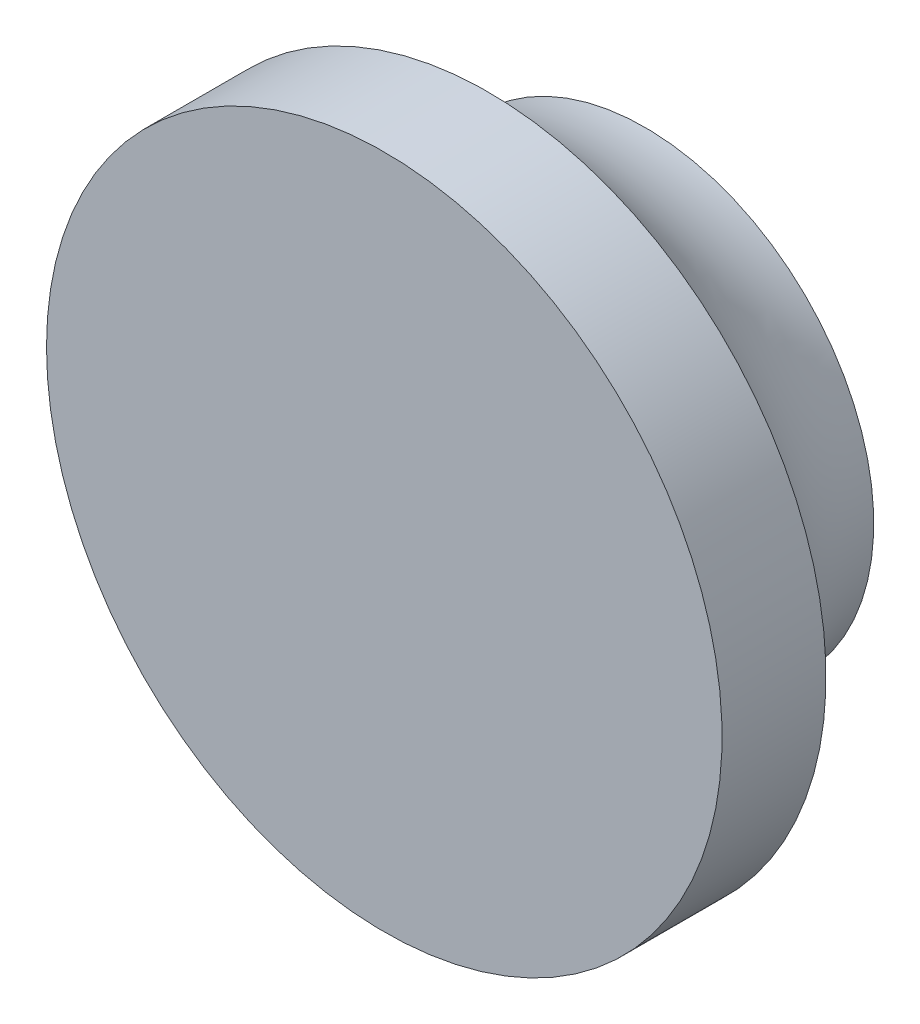
ISO-10303-21;
HEADER;
FILE_DESCRIPTION(('STEP AP214'),'2;1');
FILE_NAME('part.step','',(''),(''),'','','');
FILE_SCHEMA(('AUTOMOTIVE_DESIGN { 1 0 10303 214 1 1 1 1 }'));
ENDSEC;
DATA;
#1=APPLICATION_CONTEXT('core data for automotive mechanical design processes');
#2=APPLICATION_PROTOCOL_DEFINITION('international standard','automotive_design',2000,#1);
#3=PRODUCT_CONTEXT('',#1,'mechanical');
#4=PRODUCT('Part','Part','',(#3));
#5=PRODUCT_RELATED_PRODUCT_CATEGORY('part','',(#4));
#6=PRODUCT_DEFINITION_FORMATION('','',#4);
#7=PRODUCT_DEFINITION_CONTEXT('part definition',#1,'design');
#8=PRODUCT_DEFINITION('design','',#6,#7);
#9=PRODUCT_DEFINITION_SHAPE('','',#8);
#10=(LENGTH_UNIT() NAMED_UNIT(*) SI_UNIT(.MILLI.,.METRE.));
#11=(NAMED_UNIT(*) PLANE_ANGLE_UNIT() SI_UNIT($,.RADIAN.));
#12=(NAMED_UNIT(*) SI_UNIT($,.STERADIAN.) SOLID_ANGLE_UNIT());
#13=UNCERTAINTY_MEASURE_WITH_UNIT(LENGTH_MEASURE(1.E-05),#10,'distance_accuracy_value','');
#14=(GEOMETRIC_REPRESENTATION_CONTEXT(3) GLOBAL_UNCERTAINTY_ASSIGNED_CONTEXT((#13)) GLOBAL_UNIT_ASSIGNED_CONTEXT((#10,
#11,#12)) REPRESENTATION_CONTEXT('',''));
#15=CARTESIAN_POINT('',(0.,0.,0.));
#16=DIRECTION('',(0.,0.,1.));
#17=DIRECTION('',(1.,0.,0.));
#18=AXIS2_PLACEMENT_3D('',#15,#16,#17);
#19=CARTESIAN_POINT('',(206.339551417382,-95.896793579175,286.41183052672));
#20=DIRECTION('',(0.,0.,-1.));
#21=DIRECTION('',(-1.,0.,0.));
#22=AXIS2_PLACEMENT_3D('',#19,#20,#21);
#23=TOROIDAL_SURFACE('',#22,15.7895866131267,7.);
#24=CARTESIAN_POINT('',(206.339551417382,-95.896793579175,292.831971220494));
#25=DIRECTION('',(0.,0.,-1.));
#26=DIRECTION('',(-1.,0.,0.));
#27=AXIS2_PLACEMENT_3D('',#24,#25,#26);
#28=CIRCLE('',#27,13.);
#29=CARTESIAN_POINT('',(193.339551417382,-95.896793579175,292.831971220494));
#30=VERTEX_POINT('',#29);
#31=EDGE_CURVE('E45',#30,#30,#28,.T.);
#32=ORIENTED_EDGE('',*,*,#31,.T.);
#33=EDGE_LOOP('',(#32));
#34=FACE_BOUND('',#33,.T.);
#35=CARTESIAN_POINT('',(206.339551417382,-95.896793579175,286.793509682033));
#36=DIRECTION('',(0.,0.,-1.));
#37=DIRECTION('',(-1.,0.,0.));
#38=AXIS2_PLACEMENT_3D('',#35,#36,#37);
#39=CIRCLE('',#38,8.80000000000009);
#40=CARTESIAN_POINT('',(197.539551417381,-95.896793579175,286.793509682033));
#41=VERTEX_POINT('',#40);
#42=EDGE_CURVE('E10',#41,#41,#39,.T.);
#43=ORIENTED_EDGE('',*,*,#42,.F.);
#44=EDGE_LOOP('',(#43));
#45=FACE_BOUND('',#44,.T.);
#46=ADVANCED_FACE('F35',(#34,#45),#23,.F.);
#47=CARTESIAN_POINT('',(206.339551417381,1.73405413031072E-13,286.793509682033));
#48=DIRECTION('',(0.,0.,1.));
#49=DIRECTION('',(1.,0.,0.));
#50=AXIS2_PLACEMENT_3D('',#47,#48,#49);
#51=PLANE('',#50);
#52=ORIENTED_EDGE('',*,*,#42,.T.);
#53=EDGE_LOOP('',(#52));
#54=FACE_BOUND('',#53,.T.);
#55=ADVANCED_FACE('F61',(#54),#51,.F.);
#56=CARTESIAN_POINT('',(206.339551417381,1.73405413031072E-13,296.831971220494));
#57=DIRECTION('',(0.,0.,1.));
#58=DIRECTION('',(1.,0.,0.));
#59=AXIS2_PLACEMENT_3D('',#56,#57,#58);
#60=PLANE('',#59);
#61=CARTESIAN_POINT('',(206.339551417382,-95.896793579175,296.831971220494));
#62=DIRECTION('',(0.,0.,-1.));
#63=DIRECTION('',(-1.,0.,0.));
#64=AXIS2_PLACEMENT_3D('',#61,#62,#63);
#65=CIRCLE('',#64,13.);
#66=CARTESIAN_POINT('',(193.339551417382,-95.896793579175,296.831971220494));
#67=VERTEX_POINT('',#66);
#68=EDGE_CURVE('E41',#67,#67,#65,.T.);
#69=ORIENTED_EDGE('',*,*,#68,.F.);
#70=EDGE_LOOP('',(#69));
#71=FACE_BOUND('',#70,.T.);
#72=ADVANCED_FACE('F56',(#71),#60,.T.);
#73=CARTESIAN_POINT('',(206.339551417382,-95.896793579175,276.164391965111));
#74=DIRECTION('',(0.,0.,-1.));
#75=DIRECTION('',(-1.,0.,0.));
#76=AXIS2_PLACEMENT_3D('',#73,#74,#75);
#77=CYLINDRICAL_SURFACE('',#76,13.);
#78=ORIENTED_EDGE('',*,*,#31,.F.);
#79=EDGE_LOOP('',(#78));
#80=FACE_BOUND('',#79,.T.);
#81=ORIENTED_EDGE('',*,*,#68,.T.);
#82=EDGE_LOOP('',(#81));
#83=FACE_BOUND('',#82,.T.);
#84=ADVANCED_FACE('F54',(#80,#83),#77,.T.);
#85=CLOSED_SHELL('',(#46,#55,#72,#84));
#86=MANIFOLD_SOLID_BREP('B2',#85);
#87=ADVANCED_BREP_SHAPE_REPRESENTATION('',(#18,#86),#14);
#88=SHAPE_DEFINITION_REPRESENTATION(#9,#87);
ENDSEC;
END-ISO-10303-21;
